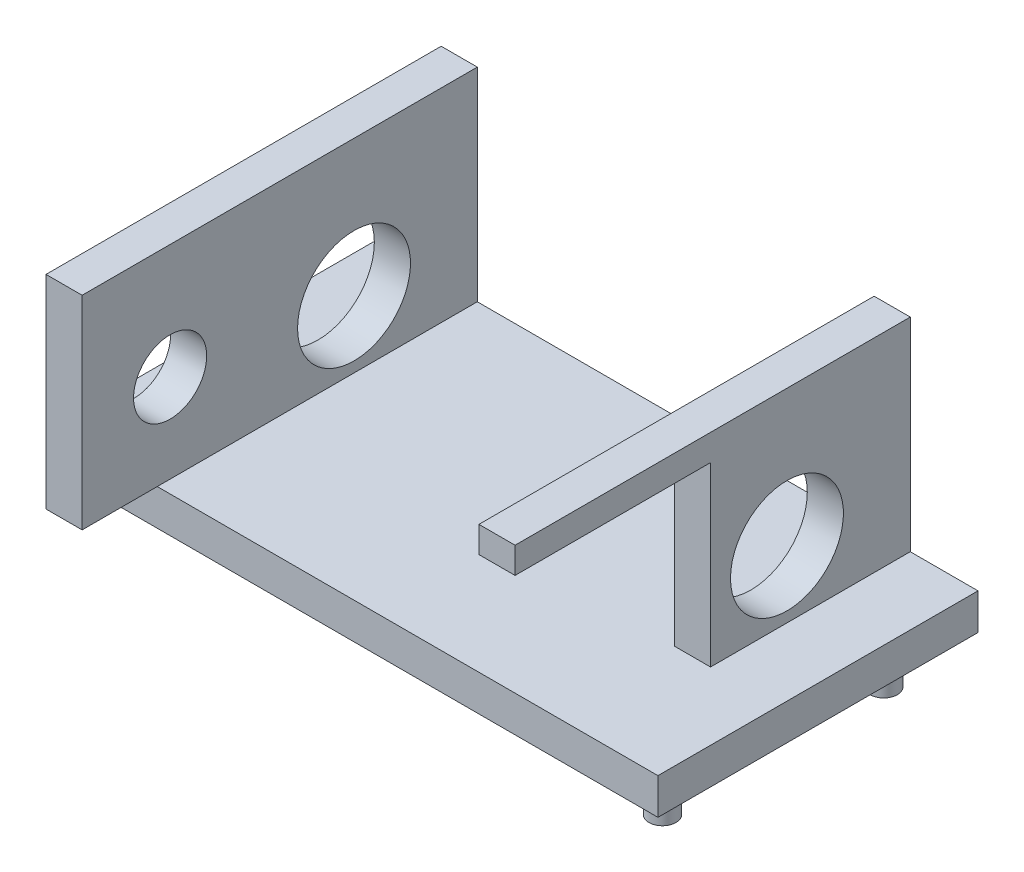
ISO-10303-21;
HEADER;
FILE_DESCRIPTION(('STEP AP214'),'2;1');
FILE_NAME('part.step','',(''),(''),'','','');
FILE_SCHEMA(('AUTOMOTIVE_DESIGN { 1 0 10303 214 1 1 1 1 }'));
ENDSEC;
DATA;
#1=APPLICATION_CONTEXT('core data for automotive mechanical design processes');
#2=APPLICATION_PROTOCOL_DEFINITION('international standard','automotive_design',2000,#1);
#3=PRODUCT_CONTEXT('',#1,'mechanical');
#4=PRODUCT('Part','Part','',(#3));
#5=PRODUCT_RELATED_PRODUCT_CATEGORY('part','',(#4));
#6=PRODUCT_DEFINITION_FORMATION('','',#4);
#7=PRODUCT_DEFINITION_CONTEXT('part definition',#1,'design');
#8=PRODUCT_DEFINITION('design','',#6,#7);
#9=PRODUCT_DEFINITION_SHAPE('','',#8);
#10=(LENGTH_UNIT() NAMED_UNIT(*) SI_UNIT(.MILLI.,.METRE.));
#11=(NAMED_UNIT(*) PLANE_ANGLE_UNIT() SI_UNIT($,.RADIAN.));
#12=(NAMED_UNIT(*) SI_UNIT($,.STERADIAN.) SOLID_ANGLE_UNIT());
#13=UNCERTAINTY_MEASURE_WITH_UNIT(LENGTH_MEASURE(1.E-05),#10,'distance_accuracy_value','');
#14=(GEOMETRIC_REPRESENTATION_CONTEXT(3) GLOBAL_UNCERTAINTY_ASSIGNED_CONTEXT((#13)) GLOBAL_UNIT_ASSIGNED_CONTEXT((#10,
#11,#12)) REPRESENTATION_CONTEXT('',''));
#15=CARTESIAN_POINT('',(0.,0.,0.));
#16=DIRECTION('',(0.,0.,1.));
#17=DIRECTION('',(1.,0.,0.));
#18=AXIS2_PLACEMENT_3D('',#15,#16,#17);
#19=CARTESIAN_POINT('',(0.,2.032,0.));
#20=DIRECTION('',(0.,1.,0.));
#21=DIRECTION('',(0.,0.,1.));
#22=AXIS2_PLACEMENT_3D('',#19,#20,#21);
#23=PLANE('',#22);
#24=DIRECTION('',(1.,0.,0.));
#25=VECTOR('',#24,1.);
#26=CARTESIAN_POINT('',(-17.,2.032,9.));
#27=LINE('',#26,#25);
#28=CARTESIAN_POINT('',(-11.158,2.032,9.));
#29=VERTEX_POINT('',#28);
#30=CARTESIAN_POINT('',(17.,2.032,9.));
#31=VERTEX_POINT('',#30);
#32=EDGE_CURVE('E256',#29,#31,#27,.T.);
#33=ORIENTED_EDGE('',*,*,#32,.T.);
#34=DIRECTION('',(0.,0.,-1.));
#35=VECTOR('',#34,1.);
#36=CARTESIAN_POINT('',(17.,2.032,-9.));
#37=LINE('',#36,#35);
#38=CARTESIAN_POINT('',(17.,2.032,-9.));
#39=VERTEX_POINT('',#38);
#40=EDGE_CURVE('E245',#31,#39,#37,.T.);
#41=ORIENTED_EDGE('',*,*,#40,.T.);
#42=DIRECTION('',(-1.,0.,0.));
#43=VECTOR('',#42,1.);
#44=CARTESIAN_POINT('',(-17.,2.032,-9.));
#45=LINE('',#44,#43);
#46=CARTESIAN_POINT('',(13.19,2.032,-9.));
#47=VERTEX_POINT('',#46);
#48=EDGE_CURVE('E250',#39,#47,#45,.T.);
#49=ORIENTED_EDGE('',*,*,#48,.T.);
#50=DIRECTION('',(0.,0.,1.));
#51=VECTOR('',#50,1.);
#52=CARTESIAN_POINT('',(13.19,2.032,0.));
#53=LINE('',#52,#51);
#54=CARTESIAN_POINT('',(13.19,2.032,2.23138596069592));
#55=VERTEX_POINT('',#54);
#56=EDGE_CURVE('E41',#47,#55,#53,.T.);
#57=ORIENTED_EDGE('',*,*,#56,.T.);
#58=DIRECTION('',(1.,0.,0.));
#59=VECTOR('',#58,1.);
#60=CARTESIAN_POINT('',(-4.50455529599177,2.032,2.23138596069592));
#61=LINE('',#60,#59);
#62=CARTESIAN_POINT('',(11.158,2.032,2.23138596069592));
#63=VERTEX_POINT('',#62);
#64=EDGE_CURVE('E146',#63,#55,#61,.T.);
#65=ORIENTED_EDGE('',*,*,#64,.F.);
#66=DIRECTION('',(0.,0.,1.));
#67=VECTOR('',#66,1.);
#68=CARTESIAN_POINT('',(11.158,2.032,-9.));
#69=LINE('',#68,#67);
#70=CARTESIAN_POINT('',(11.158,2.032,-9.));
#71=VERTEX_POINT('',#70);
#72=EDGE_CURVE('E182',#71,#63,#69,.T.);
#73=ORIENTED_EDGE('',*,*,#72,.F.);
#74=CARTESIAN_POINT('',(-11.158,2.032,-9.));
#75=VERTEX_POINT('',#74);
#76=EDGE_CURVE('E254',#71,#75,#45,.T.);
#77=ORIENTED_EDGE('',*,*,#76,.T.);
#78=DIRECTION('',(0.,0.,-1.));
#79=VECTOR('',#78,1.);
#80=CARTESIAN_POINT('',(-11.158,2.032,-9.));
#81=LINE('',#80,#79);
#82=EDGE_CURVE('E220',#29,#75,#81,.T.);
#83=ORIENTED_EDGE('',*,*,#82,.F.);
#84=EDGE_LOOP('',(#33,#41,#49,#57,#65,#73,#77,#83));
#85=FACE_BOUND('',#84,.T.);
#86=ADVANCED_FACE('F33',(#85),#23,.T.);
#87=DIRECTION('',(0.,0.,1.));
#88=VECTOR('',#87,1.);
#89=CARTESIAN_POINT('',(-13.19,2.032,-9.));
#90=LINE('',#89,#88);
#91=CARTESIAN_POINT('',(-13.19,2.032,-9.));
#92=VERTEX_POINT('',#91);
#93=CARTESIAN_POINT('',(-13.19,2.032,9.));
#94=VERTEX_POINT('',#93);
#95=EDGE_CURVE('E213',#92,#94,#90,.T.);
#96=ORIENTED_EDGE('',*,*,#95,.F.);
#97=CARTESIAN_POINT('',(-17.,2.032,-9.));
#98=VERTEX_POINT('',#97);
#99=EDGE_CURVE('E248',#92,#98,#45,.T.);
#100=ORIENTED_EDGE('',*,*,#99,.T.);
#101=DIRECTION('',(0.,0.,1.));
#102=VECTOR('',#101,1.);
#103=CARTESIAN_POINT('',(-17.,2.032,-9.));
#104=LINE('',#103,#102);
#105=CARTESIAN_POINT('',(-17.,2.032,9.));
#106=VERTEX_POINT('',#105);
#107=EDGE_CURVE('E253',#98,#106,#104,.T.);
#108=ORIENTED_EDGE('',*,*,#107,.T.);
#109=EDGE_CURVE('E257',#106,#94,#27,.T.);
#110=ORIENTED_EDGE('',*,*,#109,.T.);
#111=EDGE_LOOP('',(#96,#100,#108,#110));
#112=FACE_BOUND('',#111,.T.);
#113=ADVANCED_FACE('F318',(#112),#23,.T.);
#114=CARTESIAN_POINT('',(17.,2.032,-9.));
#115=DIRECTION('',(-1.,0.,0.));
#116=DIRECTION('',(0.,0.,1.));
#117=AXIS2_PLACEMENT_3D('',#114,#115,#116);
#118=PLANE('',#117);
#119=DIRECTION('',(0.,0.,-1.));
#120=VECTOR('',#119,1.);
#121=CARTESIAN_POINT('',(17.,0.,-9.));
#122=LINE('',#121,#120);
#123=CARTESIAN_POINT('',(17.,0.,9.));
#124=VERTEX_POINT('',#123);
#125=CARTESIAN_POINT('',(17.,0.,-9.));
#126=VERTEX_POINT('',#125);
#127=EDGE_CURVE('E244',#124,#126,#122,.T.);
#128=ORIENTED_EDGE('',*,*,#127,.T.);
#129=DIRECTION('',(0.,-1.,0.));
#130=VECTOR('',#129,1.);
#131=CARTESIAN_POINT('',(17.,2.032,-9.));
#132=LINE('',#131,#130);
#133=EDGE_CURVE('E277',#39,#126,#132,.T.);
#134=ORIENTED_EDGE('',*,*,#133,.F.);
#135=ORIENTED_EDGE('',*,*,#40,.F.);
#136=DIRECTION('',(0.,-1.,0.));
#137=VECTOR('',#136,1.);
#138=CARTESIAN_POINT('',(17.,2.032,9.));
#139=LINE('',#138,#137);
#140=EDGE_CURVE('E260',#31,#124,#139,.T.);
#141=ORIENTED_EDGE('',*,*,#140,.T.);
#142=EDGE_LOOP('',(#128,#134,#135,#141));
#143=FACE_BOUND('',#142,.T.);
#144=ADVANCED_FACE('F35',(#143),#118,.F.);
#145=CARTESIAN_POINT('',(-17.,2.032,-9.));
#146=DIRECTION('',(0.,0.,1.));
#147=DIRECTION('',(1.,0.,0.));
#148=AXIS2_PLACEMENT_3D('',#145,#146,#147);
#149=PLANE('',#148);
#150=DIRECTION('',(-1.,0.,0.));
#151=VECTOR('',#150,1.);
#152=CARTESIAN_POINT('',(-17.,0.,-9.));
#153=LINE('',#152,#151);
#154=CARTESIAN_POINT('',(-17.,0.,-9.));
#155=VERTEX_POINT('',#154);
#156=EDGE_CURVE('E264',#126,#155,#153,.T.);
#157=ORIENTED_EDGE('',*,*,#156,.T.);
#158=DIRECTION('',(0.,-1.,0.));
#159=VECTOR('',#158,1.);
#160=CARTESIAN_POINT('',(-17.,2.032,-9.));
#161=LINE('',#160,#159);
#162=EDGE_CURVE('E274',#98,#155,#161,.T.);
#163=ORIENTED_EDGE('',*,*,#162,.F.);
#164=ORIENTED_EDGE('',*,*,#99,.F.);
#165=DIRECTION('',(0.,-1.,0.));
#166=VECTOR('',#165,1.);
#167=CARTESIAN_POINT('',(-13.19,13.462,-9.));
#168=LINE('',#167,#166);
#169=CARTESIAN_POINT('',(-13.19,13.462,-9.));
#170=VERTEX_POINT('',#169);
#171=EDGE_CURVE('E212',#170,#92,#168,.T.);
#172=ORIENTED_EDGE('',*,*,#171,.F.);
#173=DIRECTION('',(-1.,0.,0.));
#174=VECTOR('',#173,1.);
#175=CARTESIAN_POINT('',(-13.19,13.462,-9.));
#176=LINE('',#175,#174);
#177=CARTESIAN_POINT('',(-11.158,13.462,-9.));
#178=VERTEX_POINT('',#177);
#179=EDGE_CURVE('E210',#178,#170,#176,.T.);
#180=ORIENTED_EDGE('',*,*,#179,.F.);
#181=DIRECTION('',(0.,-1.,0.));
#182=VECTOR('',#181,1.);
#183=CARTESIAN_POINT('',(-11.158,13.462,-9.));
#184=LINE('',#183,#182);
#185=EDGE_CURVE('E223',#178,#75,#184,.T.);
#186=ORIENTED_EDGE('',*,*,#185,.T.);
#187=ORIENTED_EDGE('',*,*,#76,.F.);
#188=DIRECTION('',(0.,-1.,0.));
#189=VECTOR('',#188,1.);
#190=CARTESIAN_POINT('',(11.158,13.462,-9.));
#191=LINE('',#190,#189);
#192=CARTESIAN_POINT('',(11.158,13.462,-9.));
#193=VERTEX_POINT('',#192);
#194=EDGE_CURVE('E55',#193,#71,#191,.T.);
#195=ORIENTED_EDGE('',*,*,#194,.F.);
#196=DIRECTION('',(-1.,0.,0.));
#197=VECTOR('',#196,1.);
#198=CARTESIAN_POINT('',(13.19,13.462,-9.));
#199=LINE('',#198,#197);
#200=CARTESIAN_POINT('',(13.19,13.462,-9.));
#201=VERTEX_POINT('',#200);
#202=EDGE_CURVE('E186',#201,#193,#199,.T.);
#203=ORIENTED_EDGE('',*,*,#202,.F.);
#204=DIRECTION('',(0.,-1.,0.));
#205=VECTOR('',#204,1.);
#206=CARTESIAN_POINT('',(13.19,13.462,-9.));
#207=LINE('',#206,#205);
#208=EDGE_CURVE('E198',#201,#47,#207,.T.);
#209=ORIENTED_EDGE('',*,*,#208,.T.);
#210=ORIENTED_EDGE('',*,*,#48,.F.);
#211=ORIENTED_EDGE('',*,*,#133,.T.);
#212=EDGE_LOOP('',(#157,#163,#164,#172,#180,#186,#187,#195,#203,#209,#210,#211));
#213=FACE_BOUND('',#212,.T.);
#214=ADVANCED_FACE('F339',(#213),#149,.F.);
#215=CARTESIAN_POINT('',(-17.,2.032,-9.));
#216=DIRECTION('',(1.,0.,0.));
#217=DIRECTION('',(0.,0.,-1.));
#218=AXIS2_PLACEMENT_3D('',#215,#216,#217);
#219=PLANE('',#218);
#220=DIRECTION('',(0.,0.,1.));
#221=VECTOR('',#220,1.);
#222=CARTESIAN_POINT('',(-17.,0.,-9.));
#223=LINE('',#222,#221);
#224=CARTESIAN_POINT('',(-17.,0.,9.));
#225=VERTEX_POINT('',#224);
#226=EDGE_CURVE('E266',#155,#225,#223,.T.);
#227=ORIENTED_EDGE('',*,*,#226,.T.);
#228=DIRECTION('',(0.,-1.,0.));
#229=VECTOR('',#228,1.);
#230=CARTESIAN_POINT('',(-17.,2.032,9.));
#231=LINE('',#230,#229);
#232=EDGE_CURVE('E271',#106,#225,#231,.T.);
#233=ORIENTED_EDGE('',*,*,#232,.F.);
#234=ORIENTED_EDGE('',*,*,#107,.F.);
#235=ORIENTED_EDGE('',*,*,#162,.T.);
#236=EDGE_LOOP('',(#227,#233,#234,#235));
#237=FACE_BOUND('',#236,.T.);
#238=ADVANCED_FACE('F336',(#237),#219,.F.);
#239=CARTESIAN_POINT('',(-17.,2.032,9.));
#240=DIRECTION('',(0.,0.,-1.));
#241=DIRECTION('',(-1.,0.,0.));
#242=AXIS2_PLACEMENT_3D('',#239,#240,#241);
#243=PLANE('',#242);
#244=DIRECTION('',(1.,0.,0.));
#245=VECTOR('',#244,1.);
#246=CARTESIAN_POINT('',(-17.,0.,9.));
#247=LINE('',#246,#245);
#248=EDGE_CURVE('E249',#225,#124,#247,.T.);
#249=ORIENTED_EDGE('',*,*,#248,.T.);
#250=ORIENTED_EDGE('',*,*,#140,.F.);
#251=ORIENTED_EDGE('',*,*,#32,.F.);
#252=EDGE_CURVE('E261',#94,#29,#27,.T.);
#253=ORIENTED_EDGE('',*,*,#252,.F.);
#254=ORIENTED_EDGE('',*,*,#109,.F.);
#255=ORIENTED_EDGE('',*,*,#232,.T.);
#256=EDGE_LOOP('',(#249,#250,#251,#253,#254,#255));
#257=FACE_BOUND('',#256,.T.);
#258=ADVANCED_FACE('F332',(#257),#243,.F.);
#259=CARTESIAN_POINT('',(0.,0.,0.));
#260=DIRECTION('',(0.,1.,0.));
#261=DIRECTION('',(0.,0.,1.));
#262=AXIS2_PLACEMENT_3D('',#259,#260,#261);
#263=PLANE('',#262);
#264=CARTESIAN_POINT('',(-15.476,0.,-6.494));
#265=DIRECTION('',(0.,1.,0.));
#266=DIRECTION('',(0.,0.,1.));
#267=AXIS2_PLACEMENT_3D('',#264,#265,#266);
#268=CIRCLE('',#267,0.762000000000003);
#269=CARTESIAN_POINT('',(-15.476,0.,-5.732));
#270=VERTEX_POINT('',#269);
#271=EDGE_CURVE('E289',#270,#270,#268,.F.);
#272=ORIENTED_EDGE('',*,*,#271,.F.);
#273=EDGE_LOOP('',(#272));
#274=FACE_BOUND('',#273,.T.);
#275=CARTESIAN_POINT('',(-15.476,0.,7.222));
#276=DIRECTION('',(0.,1.,0.));
#277=DIRECTION('',(0.,0.,1.));
#278=AXIS2_PLACEMENT_3D('',#275,#276,#277);
#279=CIRCLE('',#278,0.762000000000003);
#280=CARTESIAN_POINT('',(-15.476,0.,7.984));
#281=VERTEX_POINT('',#280);
#282=EDGE_CURVE('E286',#281,#281,#279,.F.);
#283=ORIENTED_EDGE('',*,*,#282,.F.);
#284=EDGE_LOOP('',(#283));
#285=FACE_BOUND('',#284,.T.);
#286=CARTESIAN_POINT('',(15.476,0.,7.222));
#287=DIRECTION('',(0.,1.,0.));
#288=DIRECTION('',(0.,0.,1.));
#289=AXIS2_PLACEMENT_3D('',#286,#287,#288);
#290=CIRCLE('',#289,0.762000000000001);
#291=CARTESIAN_POINT('',(15.476,0.,7.984));
#292=VERTEX_POINT('',#291);
#293=EDGE_CURVE('E283',#292,#292,#290,.F.);
#294=ORIENTED_EDGE('',*,*,#293,.F.);
#295=EDGE_LOOP('',(#294));
#296=FACE_BOUND('',#295,.T.);
#297=CARTESIAN_POINT('',(15.476,0.,-5.224));
#298=DIRECTION('',(0.,1.,0.));
#299=DIRECTION('',(0.,0.,1.));
#300=AXIS2_PLACEMENT_3D('',#297,#298,#299);
#301=CIRCLE('',#300,0.762000000000001);
#302=CARTESIAN_POINT('',(15.476,0.,-4.462));
#303=VERTEX_POINT('',#302);
#304=EDGE_CURVE('E280',#303,#303,#301,.F.);
#305=ORIENTED_EDGE('',*,*,#304,.F.);
#306=EDGE_LOOP('',(#305));
#307=FACE_BOUND('',#306,.T.);
#308=ORIENTED_EDGE('',*,*,#127,.F.);
#309=ORIENTED_EDGE('',*,*,#248,.F.);
#310=ORIENTED_EDGE('',*,*,#226,.F.);
#311=ORIENTED_EDGE('',*,*,#156,.F.);
#312=EDGE_LOOP('',(#308,#309,#310,#311));
#313=FACE_BOUND('',#312,.T.);
#314=ADVANCED_FACE('F329',(#274,#285,#296,#307,#313),#263,.F.);
#315=CARTESIAN_POINT('',(15.476,-1.524,-5.224));
#316=DIRECTION('',(0.,1.,0.));
#317=DIRECTION('',(0.,0.,1.));
#318=AXIS2_PLACEMENT_3D('',#315,#316,#317);
#319=CYLINDRICAL_SURFACE('',#318,0.762000000000001);
#320=CARTESIAN_POINT('',(15.476,-1.524,-5.224));
#321=DIRECTION('',(0.,-1.,0.));
#322=DIRECTION('',(0.,0.,-1.));
#323=AXIS2_PLACEMENT_3D('',#320,#321,#322);
#324=CIRCLE('',#323,0.762000000000001);
#325=CARTESIAN_POINT('',(15.476,-1.524,-5.98600000000001));
#326=VERTEX_POINT('',#325);
#327=EDGE_CURVE('E241',#326,#326,#324,.T.);
#328=ORIENTED_EDGE('',*,*,#327,.F.);
#329=EDGE_LOOP('',(#328));
#330=FACE_BOUND('',#329,.T.);
#331=ORIENTED_EDGE('',*,*,#304,.T.);
#332=EDGE_LOOP('',(#331));
#333=FACE_BOUND('',#332,.T.);
#334=ADVANCED_FACE('F327',(#330,#333),#319,.T.);
#335=CARTESIAN_POINT('',(15.476,-1.524,-5.224));
#336=DIRECTION('',(0.,-1.,0.));
#337=DIRECTION('',(0.,0.,-1.));
#338=AXIS2_PLACEMENT_3D('',#335,#336,#337);
#339=PLANE('',#338);
#340=ORIENTED_EDGE('',*,*,#327,.T.);
#341=EDGE_LOOP('',(#340));
#342=FACE_BOUND('',#341,.T.);
#343=ADVANCED_FACE('F560',(#342),#339,.T.);
#344=CARTESIAN_POINT('',(15.476,-1.524,7.222));
#345=DIRECTION('',(0.,1.,0.));
#346=DIRECTION('',(0.,0.,1.));
#347=AXIS2_PLACEMENT_3D('',#344,#345,#346);
#348=CYLINDRICAL_SURFACE('',#347,0.762000000000001);
#349=CARTESIAN_POINT('',(15.476,-1.524,7.222));
#350=DIRECTION('',(0.,-1.,0.));
#351=DIRECTION('',(0.,0.,-1.));
#352=AXIS2_PLACEMENT_3D('',#349,#350,#351);
#353=CIRCLE('',#352,0.762000000000001);
#354=CARTESIAN_POINT('',(15.476,-1.524,6.46));
#355=VERTEX_POINT('',#354);
#356=EDGE_CURVE('E238',#355,#355,#353,.T.);
#357=ORIENTED_EDGE('',*,*,#356,.F.);
#358=EDGE_LOOP('',(#357));
#359=FACE_BOUND('',#358,.T.);
#360=ORIENTED_EDGE('',*,*,#293,.T.);
#361=EDGE_LOOP('',(#360));
#362=FACE_BOUND('',#361,.T.);
#363=ADVANCED_FACE('F550',(#359,#362),#348,.T.);
#364=CARTESIAN_POINT('',(15.476,-1.524,7.222));
#365=DIRECTION('',(0.,-1.,0.));
#366=DIRECTION('',(0.,0.,-1.));
#367=AXIS2_PLACEMENT_3D('',#364,#365,#366);
#368=PLANE('',#367);
#369=ORIENTED_EDGE('',*,*,#356,.T.);
#370=EDGE_LOOP('',(#369));
#371=FACE_BOUND('',#370,.T.);
#372=ADVANCED_FACE('F540',(#371),#368,.T.);
#373=CARTESIAN_POINT('',(-15.476,-1.524,7.222));
#374=DIRECTION('',(0.,1.,0.));
#375=DIRECTION('',(0.,0.,1.));
#376=AXIS2_PLACEMENT_3D('',#373,#374,#375);
#377=CYLINDRICAL_SURFACE('',#376,0.762000000000003);
#378=CARTESIAN_POINT('',(-15.476,-1.524,7.222));
#379=DIRECTION('',(0.,-1.,0.));
#380=DIRECTION('',(0.,0.,-1.));
#381=AXIS2_PLACEMENT_3D('',#378,#379,#380);
#382=CIRCLE('',#381,0.762000000000003);
#383=CARTESIAN_POINT('',(-15.476,-1.524,6.45999999999999));
#384=VERTEX_POINT('',#383);
#385=EDGE_CURVE('E235',#384,#384,#382,.T.);
#386=ORIENTED_EDGE('',*,*,#385,.F.);
#387=EDGE_LOOP('',(#386));
#388=FACE_BOUND('',#387,.T.);
#389=ORIENTED_EDGE('',*,*,#282,.T.);
#390=EDGE_LOOP('',(#389));
#391=FACE_BOUND('',#390,.T.);
#392=ADVANCED_FACE('F530',(#388,#391),#377,.T.);
#393=CARTESIAN_POINT('',(-15.476,-1.524,7.222));
#394=DIRECTION('',(0.,-1.,0.));
#395=DIRECTION('',(0.,0.,-1.));
#396=AXIS2_PLACEMENT_3D('',#393,#394,#395);
#397=PLANE('',#396);
#398=ORIENTED_EDGE('',*,*,#385,.T.);
#399=EDGE_LOOP('',(#398));
#400=FACE_BOUND('',#399,.T.);
#401=ADVANCED_FACE('F520',(#400),#397,.T.);
#402=CARTESIAN_POINT('',(-15.476,-1.524,-6.494));
#403=DIRECTION('',(0.,1.,0.));
#404=DIRECTION('',(0.,0.,1.));
#405=AXIS2_PLACEMENT_3D('',#402,#403,#404);
#406=CYLINDRICAL_SURFACE('',#405,0.762000000000003);
#407=CARTESIAN_POINT('',(-15.476,-1.524,-6.494));
#408=DIRECTION('',(0.,-1.,0.));
#409=DIRECTION('',(0.,0.,-1.));
#410=AXIS2_PLACEMENT_3D('',#407,#408,#409);
#411=CIRCLE('',#410,0.762000000000003);
#412=CARTESIAN_POINT('',(-15.476,-1.524,-7.25600000000001));
#413=VERTEX_POINT('',#412);
#414=EDGE_CURVE('E232',#413,#413,#411,.T.);
#415=ORIENTED_EDGE('',*,*,#414,.F.);
#416=EDGE_LOOP('',(#415));
#417=FACE_BOUND('',#416,.T.);
#418=ORIENTED_EDGE('',*,*,#271,.T.);
#419=EDGE_LOOP('',(#418));
#420=FACE_BOUND('',#419,.T.);
#421=ADVANCED_FACE('F510',(#417,#420),#406,.T.);
#422=CARTESIAN_POINT('',(-15.476,-1.524,-6.494));
#423=DIRECTION('',(0.,-1.,0.));
#424=DIRECTION('',(0.,0.,-1.));
#425=AXIS2_PLACEMENT_3D('',#422,#423,#424);
#426=PLANE('',#425);
#427=ORIENTED_EDGE('',*,*,#414,.T.);
#428=EDGE_LOOP('',(#427));
#429=FACE_BOUND('',#428,.T.);
#430=ADVANCED_FACE('F491',(#429),#426,.T.);
#431=CARTESIAN_POINT('',(0.,2.032,0.));
#432=DIRECTION('',(0.,1.,0.));
#433=DIRECTION('',(0.,0.,1.));
#434=AXIS2_PLACEMENT_3D('',#431,#432,#433);
#435=PLANE('',#434);
#436=CARTESIAN_POINT('',(-13.19,2.032,13.225));
#437=VERTEX_POINT('',#436);
#438=EDGE_CURVE('E201',#94,#437,#90,.T.);
#439=ORIENTED_EDGE('',*,*,#438,.F.);
#440=ORIENTED_EDGE('',*,*,#252,.T.);
#441=CARTESIAN_POINT('',(-11.158,2.032,13.225));
#442=VERTEX_POINT('',#441);
#443=EDGE_CURVE('E206',#442,#29,#81,.T.);
#444=ORIENTED_EDGE('',*,*,#443,.F.);
#445=DIRECTION('',(1.,0.,0.));
#446=VECTOR('',#445,1.);
#447=CARTESIAN_POINT('',(-13.19,2.032,13.225));
#448=LINE('',#447,#446);
#449=EDGE_CURVE('E216',#437,#442,#448,.T.);
#450=ORIENTED_EDGE('',*,*,#449,.F.);
#451=EDGE_LOOP('',(#439,#440,#444,#450));
#452=FACE_BOUND('',#451,.T.);
#453=ADVANCED_FACE('F365',(#452),#435,.F.);
#454=CARTESIAN_POINT('',(-13.19,13.462,-9.));
#455=DIRECTION('',(1.,0.,0.));
#456=DIRECTION('',(0.,0.,-1.));
#457=AXIS2_PLACEMENT_3D('',#454,#455,#456);
#458=PLANE('',#457);
#459=CARTESIAN_POINT('',(-13.19,5.7912,-2.0658));
#460=DIRECTION('',(1.,0.,0.));
#461=DIRECTION('',(0.,0.,-1.));
#462=AXIS2_PLACEMENT_3D('',#459,#460,#461);
#463=CIRCLE('',#462,3.175);
#464=CARTESIAN_POINT('',(-13.19,5.7912,-5.2408));
#465=VERTEX_POINT('',#464);
#466=EDGE_CURVE('E173',#465,#465,#463,.T.);
#467=ORIENTED_EDGE('',*,*,#466,.T.);
#468=EDGE_LOOP('',(#467));
#469=FACE_BOUND('',#468,.T.);
#470=CARTESIAN_POINT('',(-13.19,7.0104,8.27658596069592));
#471=DIRECTION('',(1.,0.,0.));
#472=DIRECTION('',(0.,0.,-1.));
#473=AXIS2_PLACEMENT_3D('',#470,#471,#472);
#474=CIRCLE('',#473,2.0574);
#475=CARTESIAN_POINT('',(-13.19,7.0104,6.21918596069592));
#476=VERTEX_POINT('',#475);
#477=EDGE_CURVE('E179',#476,#476,#474,.T.);
#478=ORIENTED_EDGE('',*,*,#477,.T.);
#479=EDGE_LOOP('',(#478));
#480=FACE_BOUND('',#479,.T.);
#481=ORIENTED_EDGE('',*,*,#95,.T.);
#482=ORIENTED_EDGE('',*,*,#438,.T.);
#483=DIRECTION('',(0.,-1.,0.));
#484=VECTOR('',#483,1.);
#485=CARTESIAN_POINT('',(-13.19,13.462,13.225));
#486=LINE('',#485,#484);
#487=CARTESIAN_POINT('',(-13.19,13.462,13.225));
#488=VERTEX_POINT('',#487);
#489=EDGE_CURVE('E229',#488,#437,#486,.T.);
#490=ORIENTED_EDGE('',*,*,#489,.F.);
#491=DIRECTION('',(0.,0.,1.));
#492=VECTOR('',#491,1.);
#493=CARTESIAN_POINT('',(-13.19,13.462,-9.));
#494=LINE('',#493,#492);
#495=EDGE_CURVE('E202',#170,#488,#494,.T.);
#496=ORIENTED_EDGE('',*,*,#495,.F.);
#497=ORIENTED_EDGE('',*,*,#171,.T.);
#498=EDGE_LOOP('',(#481,#482,#490,#496,#497));
#499=FACE_BOUND('',#498,.T.);
#500=ADVANCED_FACE('F376',(#469,#480,#499),#458,.F.);
#501=CARTESIAN_POINT('',(-13.19,13.462,13.225));
#502=DIRECTION('',(0.,0.,-1.));
#503=DIRECTION('',(-1.,0.,0.));
#504=AXIS2_PLACEMENT_3D('',#501,#502,#503);
#505=PLANE('',#504);
#506=ORIENTED_EDGE('',*,*,#449,.T.);
#507=DIRECTION('',(0.,-1.,0.));
#508=VECTOR('',#507,1.);
#509=CARTESIAN_POINT('',(-11.158,13.462,13.225));
#510=LINE('',#509,#508);
#511=CARTESIAN_POINT('',(-11.158,13.462,13.225));
#512=VERTEX_POINT('',#511);
#513=EDGE_CURVE('E226',#512,#442,#510,.T.);
#514=ORIENTED_EDGE('',*,*,#513,.F.);
#515=DIRECTION('',(1.,0.,0.));
#516=VECTOR('',#515,1.);
#517=CARTESIAN_POINT('',(-13.19,13.462,13.225));
#518=LINE('',#517,#516);
#519=EDGE_CURVE('E205',#488,#512,#518,.T.);
#520=ORIENTED_EDGE('',*,*,#519,.F.);
#521=ORIENTED_EDGE('',*,*,#489,.T.);
#522=EDGE_LOOP('',(#506,#514,#520,#521));
#523=FACE_BOUND('',#522,.T.);
#524=ADVANCED_FACE('F372',(#523),#505,.F.);
#525=CARTESIAN_POINT('',(-11.158,13.462,-9.));
#526=DIRECTION('',(-1.,0.,0.));
#527=DIRECTION('',(0.,0.,1.));
#528=AXIS2_PLACEMENT_3D('',#525,#526,#527);
#529=PLANE('',#528);
#530=CARTESIAN_POINT('',(-11.158,5.7912,-2.0658));
#531=DIRECTION('',(-1.,0.,0.));
#532=DIRECTION('',(0.,0.,1.));
#533=AXIS2_PLACEMENT_3D('',#530,#531,#532);
#534=CIRCLE('',#533,3.175);
#535=CARTESIAN_POINT('',(-11.158,5.7912,1.1092));
#536=VERTEX_POINT('',#535);
#537=EDGE_CURVE('E170',#536,#536,#534,.T.);
#538=ORIENTED_EDGE('',*,*,#537,.T.);
#539=EDGE_LOOP('',(#538));
#540=FACE_BOUND('',#539,.T.);
#541=CARTESIAN_POINT('',(-11.158,7.0104,8.27658596069592));
#542=DIRECTION('',(-1.,0.,0.));
#543=DIRECTION('',(0.,0.,1.));
#544=AXIS2_PLACEMENT_3D('',#541,#542,#543);
#545=CIRCLE('',#544,2.0574);
#546=CARTESIAN_POINT('',(-11.158,7.0104,10.3339859606959));
#547=VERTEX_POINT('',#546);
#548=EDGE_CURVE('E176',#547,#547,#545,.T.);
#549=ORIENTED_EDGE('',*,*,#548,.T.);
#550=EDGE_LOOP('',(#549));
#551=FACE_BOUND('',#550,.T.);
#552=ORIENTED_EDGE('',*,*,#443,.T.);
#553=ORIENTED_EDGE('',*,*,#82,.T.);
#554=ORIENTED_EDGE('',*,*,#185,.F.);
#555=DIRECTION('',(0.,0.,-1.));
#556=VECTOR('',#555,1.);
#557=CARTESIAN_POINT('',(-11.158,13.462,-9.));
#558=LINE('',#557,#556);
#559=EDGE_CURVE('E208',#512,#178,#558,.T.);
#560=ORIENTED_EDGE('',*,*,#559,.F.);
#561=ORIENTED_EDGE('',*,*,#513,.T.);
#562=EDGE_LOOP('',(#552,#553,#554,#560,#561));
#563=FACE_BOUND('',#562,.T.);
#564=ADVANCED_FACE('F314',(#540,#551,#563),#529,.F.);
#565=CARTESIAN_POINT('',(0.,13.462,0.));
#566=DIRECTION('',(0.,1.,0.));
#567=DIRECTION('',(0.,0.,1.));
#568=AXIS2_PLACEMENT_3D('',#565,#566,#567);
#569=PLANE('',#568);
#570=ORIENTED_EDGE('',*,*,#495,.T.);
#571=ORIENTED_EDGE('',*,*,#519,.T.);
#572=ORIENTED_EDGE('',*,*,#559,.T.);
#573=ORIENTED_EDGE('',*,*,#179,.T.);
#574=EDGE_LOOP('',(#570,#571,#572,#573));
#575=FACE_BOUND('',#574,.T.);
#576=ADVANCED_FACE('F306',(#575),#569,.T.);
#577=CARTESIAN_POINT('',(13.19,13.462,-9.));
#578=DIRECTION('',(-1.,0.,0.));
#579=DIRECTION('',(0.,0.,1.));
#580=AXIS2_PLACEMENT_3D('',#577,#578,#579);
#581=PLANE('',#580);
#582=CARTESIAN_POINT('',(13.19,5.7912,-2.0658));
#583=DIRECTION('',(-1.,0.,0.));
#584=DIRECTION('',(0.,0.,1.));
#585=AXIS2_PLACEMENT_3D('',#582,#583,#584);
#586=CIRCLE('',#585,3.175);
#587=CARTESIAN_POINT('',(13.19,5.7912,1.1092));
#588=VERTEX_POINT('',#587);
#589=EDGE_CURVE('E167',#588,#588,#586,.T.);
#590=ORIENTED_EDGE('',*,*,#589,.T.);
#591=EDGE_LOOP('',(#590));
#592=FACE_BOUND('',#591,.T.);
#593=DIRECTION('',(0.,0.,1.));
#594=VECTOR('',#593,1.);
#595=CARTESIAN_POINT('',(13.19,11.9888,14.3217859606959));
#596=LINE('',#595,#594);
#597=CARTESIAN_POINT('',(13.19,11.9888,2.23138596069592));
#598=VERTEX_POINT('',#597);
#599=CARTESIAN_POINT('',(13.19,11.9888,13.225));
#600=VERTEX_POINT('',#599);
#601=EDGE_CURVE('E48',#598,#600,#596,.T.);
#602=ORIENTED_EDGE('',*,*,#601,.F.);
#603=DIRECTION('',(0.,1.,0.));
#604=VECTOR('',#603,1.);
#605=CARTESIAN_POINT('',(13.19,11.9888,2.23138596069592));
#606=LINE('',#605,#604);
#607=EDGE_CURVE('E149',#55,#598,#606,.T.);
#608=ORIENTED_EDGE('',*,*,#607,.F.);
#609=ORIENTED_EDGE('',*,*,#56,.F.);
#610=ORIENTED_EDGE('',*,*,#208,.F.);
#611=DIRECTION('',(0.,0.,-1.));
#612=VECTOR('',#611,1.);
#613=CARTESIAN_POINT('',(13.19,13.462,-9.));
#614=LINE('',#613,#612);
#615=CARTESIAN_POINT('',(13.19,13.462,13.225));
#616=VERTEX_POINT('',#615);
#617=EDGE_CURVE('E183',#616,#201,#614,.T.);
#618=ORIENTED_EDGE('',*,*,#617,.F.);
#619=DIRECTION('',(0.,-1.,0.));
#620=VECTOR('',#619,1.);
#621=CARTESIAN_POINT('',(13.19,13.462,13.225));
#622=LINE('',#621,#620);
#623=EDGE_CURVE('E159',#616,#600,#622,.T.);
#624=ORIENTED_EDGE('',*,*,#623,.T.);
#625=EDGE_LOOP('',(#602,#608,#609,#610,#618,#624));
#626=FACE_BOUND('',#625,.T.);
#627=ADVANCED_FACE('F156',(#592,#626),#581,.F.);
#628=CARTESIAN_POINT('',(11.158,13.462,-9.));
#629=DIRECTION('',(1.,0.,0.));
#630=DIRECTION('',(0.,0.,-1.));
#631=AXIS2_PLACEMENT_3D('',#628,#629,#630);
#632=PLANE('',#631);
#633=CARTESIAN_POINT('',(11.158,5.7912,-2.0658));
#634=DIRECTION('',(1.,0.,0.));
#635=DIRECTION('',(0.,0.,-1.));
#636=AXIS2_PLACEMENT_3D('',#633,#634,#635);
#637=CIRCLE('',#636,3.175);
#638=CARTESIAN_POINT('',(11.158,5.7912,-5.2408));
#639=VERTEX_POINT('',#638);
#640=EDGE_CURVE('E166',#639,#639,#637,.T.);
#641=ORIENTED_EDGE('',*,*,#640,.T.);
#642=EDGE_LOOP('',(#641));
#643=FACE_BOUND('',#642,.T.);
#644=ORIENTED_EDGE('',*,*,#72,.T.);
#645=DIRECTION('',(0.,-1.,0.));
#646=VECTOR('',#645,1.);
#647=CARTESIAN_POINT('',(11.158,11.9888,2.23138596069592));
#648=LINE('',#647,#646);
#649=CARTESIAN_POINT('',(11.158,11.9888,2.23138596069592));
#650=VERTEX_POINT('',#649);
#651=EDGE_CURVE('E163',#650,#63,#648,.T.);
#652=ORIENTED_EDGE('',*,*,#651,.F.);
#653=DIRECTION('',(0.,0.,-1.));
#654=VECTOR('',#653,1.);
#655=CARTESIAN_POINT('',(11.158,11.9888,14.3217859606959));
#656=LINE('',#655,#654);
#657=CARTESIAN_POINT('',(11.158,11.9888,13.225));
#658=VERTEX_POINT('',#657);
#659=EDGE_CURVE('E143',#658,#650,#656,.T.);
#660=ORIENTED_EDGE('',*,*,#659,.F.);
#661=DIRECTION('',(0.,-1.,0.));
#662=VECTOR('',#661,1.);
#663=CARTESIAN_POINT('',(11.158,13.462,13.225));
#664=LINE('',#663,#662);
#665=CARTESIAN_POINT('',(11.158,13.462,13.225));
#666=VERTEX_POINT('',#665);
#667=EDGE_CURVE('E194',#666,#658,#664,.T.);
#668=ORIENTED_EDGE('',*,*,#667,.F.);
#669=DIRECTION('',(0.,0.,1.));
#670=VECTOR('',#669,1.);
#671=CARTESIAN_POINT('',(11.158,13.462,-9.));
#672=LINE('',#671,#670);
#673=EDGE_CURVE('E188',#193,#666,#672,.T.);
#674=ORIENTED_EDGE('',*,*,#673,.F.);
#675=ORIENTED_EDGE('',*,*,#194,.T.);
#676=EDGE_LOOP('',(#644,#652,#660,#668,#674,#675));
#677=FACE_BOUND('',#676,.T.);
#678=ADVANCED_FACE('F295',(#643,#677),#632,.F.);
#679=CARTESIAN_POINT('',(13.19,13.462,13.225));
#680=DIRECTION('',(0.,0.,-1.));
#681=DIRECTION('',(-1.,0.,0.));
#682=AXIS2_PLACEMENT_3D('',#679,#680,#681);
#683=PLANE('',#682);
#684=ORIENTED_EDGE('',*,*,#667,.T.);
#685=DIRECTION('',(1.,0.,0.));
#686=VECTOR('',#685,1.);
#687=CARTESIAN_POINT('',(13.19,11.9888,13.225));
#688=LINE('',#687,#686);
#689=EDGE_CURVE('E11',#658,#600,#688,.T.);
#690=ORIENTED_EDGE('',*,*,#689,.T.);
#691=ORIENTED_EDGE('',*,*,#623,.F.);
#692=DIRECTION('',(1.,0.,0.));
#693=VECTOR('',#692,1.);
#694=CARTESIAN_POINT('',(13.19,13.462,13.225));
#695=LINE('',#694,#693);
#696=EDGE_CURVE('E190',#666,#616,#695,.T.);
#697=ORIENTED_EDGE('',*,*,#696,.F.);
#698=EDGE_LOOP('',(#684,#690,#691,#697));
#699=FACE_BOUND('',#698,.T.);
#700=ADVANCED_FACE('F312',(#699),#683,.F.);
#701=CARTESIAN_POINT('',(0.,13.462,0.));
#702=DIRECTION('',(0.,-1.,0.));
#703=DIRECTION('',(0.,0.,-1.));
#704=AXIS2_PLACEMENT_3D('',#701,#702,#703);
#705=PLANE('',#704);
#706=ORIENTED_EDGE('',*,*,#617,.T.);
#707=ORIENTED_EDGE('',*,*,#202,.T.);
#708=ORIENTED_EDGE('',*,*,#673,.T.);
#709=ORIENTED_EDGE('',*,*,#696,.T.);
#710=EDGE_LOOP('',(#706,#707,#708,#709));
#711=FACE_BOUND('',#710,.T.);
#712=ADVANCED_FACE('F383',(#711),#705,.F.);
#713=CARTESIAN_POINT('',(17.,7.0104,8.27658596069592));
#714=DIRECTION('',(-1.,0.,0.));
#715=DIRECTION('',(0.,0.,1.));
#716=AXIS2_PLACEMENT_3D('',#713,#714,#715);
#717=CYLINDRICAL_SURFACE('',#716,2.0574);
#718=ORIENTED_EDGE('',*,*,#548,.F.);
#719=EDGE_LOOP('',(#718));
#720=FACE_BOUND('',#719,.T.);
#721=ORIENTED_EDGE('',*,*,#477,.F.);
#722=EDGE_LOOP('',(#721));
#723=FACE_BOUND('',#722,.T.);
#724=ADVANCED_FACE('F301',(#720,#723),#717,.F.);
#725=CARTESIAN_POINT('',(17.,5.7912,-2.0658));
#726=DIRECTION('',(-1.,0.,0.));
#727=DIRECTION('',(0.,0.,1.));
#728=AXIS2_PLACEMENT_3D('',#725,#726,#727);
#729=CYLINDRICAL_SURFACE('',#728,3.175);
#730=ORIENTED_EDGE('',*,*,#640,.F.);
#731=EDGE_LOOP('',(#730));
#732=FACE_BOUND('',#731,.T.);
#733=ORIENTED_EDGE('',*,*,#589,.F.);
#734=EDGE_LOOP('',(#733));
#735=FACE_BOUND('',#734,.T.);
#736=ADVANCED_FACE('F297',(#732,#735),#729,.F.);
#737=ORIENTED_EDGE('',*,*,#537,.F.);
#738=EDGE_LOOP('',(#737));
#739=FACE_BOUND('',#738,.T.);
#740=ORIENTED_EDGE('',*,*,#466,.F.);
#741=EDGE_LOOP('',(#740));
#742=FACE_BOUND('',#741,.T.);
#743=ADVANCED_FACE('F300',(#739,#742),#729,.F.);
#744=CARTESIAN_POINT('',(-4.50455529599177,11.9888,14.3217859606959));
#745=DIRECTION('',(0.,1.,0.));
#746=DIRECTION('',(0.,0.,1.));
#747=AXIS2_PLACEMENT_3D('',#744,#745,#746);
#748=PLANE('',#747);
#749=ORIENTED_EDGE('',*,*,#659,.T.);
#750=DIRECTION('',(1.,0.,0.));
#751=VECTOR('',#750,1.);
#752=CARTESIAN_POINT('',(-4.50455529599177,11.9888,2.23138596069592));
#753=LINE('',#752,#751);
#754=EDGE_CURVE('E139',#650,#598,#753,.T.);
#755=ORIENTED_EDGE('',*,*,#754,.T.);
#756=ORIENTED_EDGE('',*,*,#601,.T.);
#757=ORIENTED_EDGE('',*,*,#689,.F.);
#758=EDGE_LOOP('',(#749,#755,#756,#757));
#759=FACE_BOUND('',#758,.T.);
#760=ADVANCED_FACE('F141',(#759),#748,.F.);
#761=CARTESIAN_POINT('',(-4.50455529599177,11.9888,2.23138596069592));
#762=DIRECTION('',(0.,0.,-1.));
#763=DIRECTION('',(0.,1.,0.));
#764=AXIS2_PLACEMENT_3D('',#761,#762,#763);
#765=PLANE('',#764);
#766=ORIENTED_EDGE('',*,*,#651,.T.);
#767=ORIENTED_EDGE('',*,*,#64,.T.);
#768=ORIENTED_EDGE('',*,*,#607,.T.);
#769=ORIENTED_EDGE('',*,*,#754,.F.);
#770=EDGE_LOOP('',(#766,#767,#768,#769));
#771=FACE_BOUND('',#770,.T.);
#772=ADVANCED_FACE('F150',(#771),#765,.F.);
#773=CLOSED_SHELL('',(#86,#113,#144,#214,#238,#258,#314,#334,#343,#363,#372,#392,#401,#421,#430,
#453,#500,#524,#564,#576,#627,#678,#700,#712,#724,#736,#743,#760,#772));
#774=MANIFOLD_SOLID_BREP('B2',#773);
#775=ADVANCED_BREP_SHAPE_REPRESENTATION('',(#18,#774),#14);
#776=SHAPE_DEFINITION_REPRESENTATION(#9,#775);
ENDSEC;
END-ISO-10303-21;
